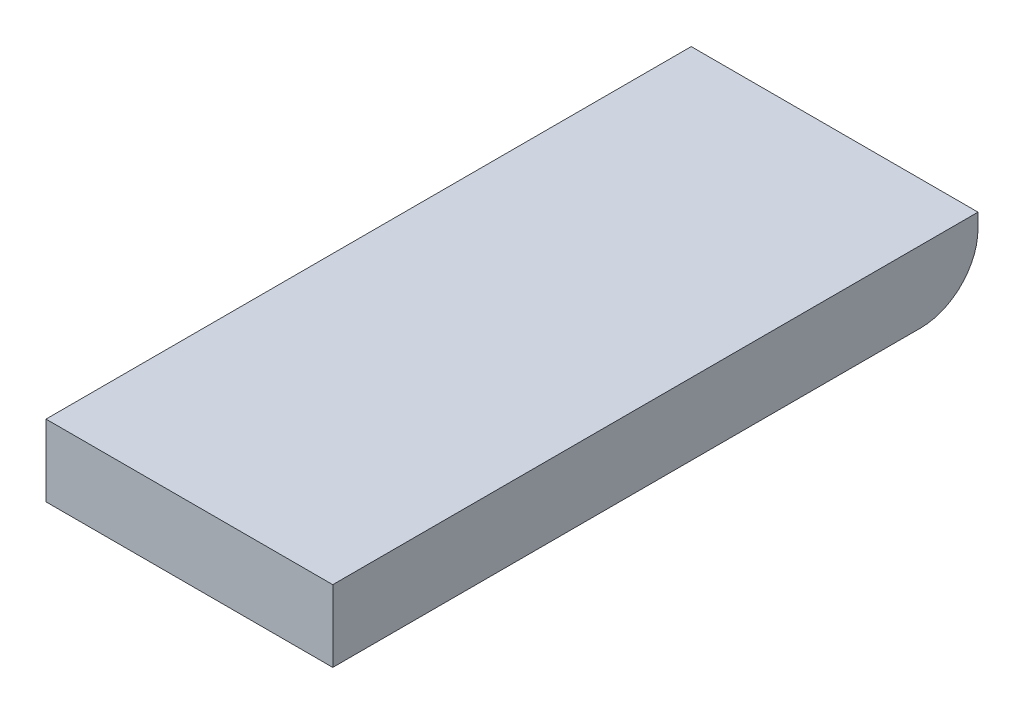
ISO-10303-21;
HEADER;
FILE_DESCRIPTION(('STEP AP214'),'2;1');
FILE_NAME('part.step','',(''),(''),'','','');
FILE_SCHEMA(('AUTOMOTIVE_DESIGN { 1 0 10303 214 1 1 1 1 }'));
ENDSEC;
DATA;
#1=APPLICATION_CONTEXT('core data for automotive mechanical design processes');
#2=APPLICATION_PROTOCOL_DEFINITION('international standard','automotive_design',2000,#1);
#3=PRODUCT_CONTEXT('',#1,'mechanical');
#4=PRODUCT('Part','Part','',(#3));
#5=PRODUCT_RELATED_PRODUCT_CATEGORY('part','',(#4));
#6=PRODUCT_DEFINITION_FORMATION('','',#4);
#7=PRODUCT_DEFINITION_CONTEXT('part definition',#1,'design');
#8=PRODUCT_DEFINITION('design','',#6,#7);
#9=PRODUCT_DEFINITION_SHAPE('','',#8);
#10=(LENGTH_UNIT() NAMED_UNIT(*) SI_UNIT(.MILLI.,.METRE.));
#11=(NAMED_UNIT(*) PLANE_ANGLE_UNIT() SI_UNIT($,.RADIAN.));
#12=(NAMED_UNIT(*) SI_UNIT($,.STERADIAN.) SOLID_ANGLE_UNIT());
#13=UNCERTAINTY_MEASURE_WITH_UNIT(LENGTH_MEASURE(1.E-05),#10,'distance_accuracy_value','');
#14=(GEOMETRIC_REPRESENTATION_CONTEXT(3) GLOBAL_UNCERTAINTY_ASSIGNED_CONTEXT((#13)) GLOBAL_UNIT_ASSIGNED_CONTEXT((#10,
#11,#12)) REPRESENTATION_CONTEXT('',''));
#15=CARTESIAN_POINT('',(0.,0.,0.));
#16=DIRECTION('',(0.,0.,1.));
#17=DIRECTION('',(1.,0.,0.));
#18=AXIS2_PLACEMENT_3D('',#15,#16,#17);
#19=CARTESIAN_POINT('',(4.4,0.1,3.95));
#20=DIRECTION('',(-1.,0.,0.));
#21=DIRECTION('',(0.,0.,1.));
#22=AXIS2_PLACEMENT_3D('',#19,#20,#21);
#23=CYLINDRICAL_SURFACE('',#22,0.2);
#24=CARTESIAN_POINT('',(5.4,0.1,3.95));
#25=DIRECTION('',(-1.,0.,0.));
#26=DIRECTION('',(0.,0.,1.));
#27=AXIS2_PLACEMENT_3D('',#24,#25,#26);
#28=CIRCLE('',#27,0.2);
#29=CARTESIAN_POINT('',(5.4,-0.1,3.95));
#30=VERTEX_POINT('',#29);
#31=CARTESIAN_POINT('',(5.4,0.1,3.75));
#32=VERTEX_POINT('',#31);
#33=EDGE_CURVE('E21',#30,#32,#28,.F.);
#34=ORIENTED_EDGE('',*,*,#33,.F.);
#35=DIRECTION('',(1.,0.,0.));
#36=VECTOR('',#35,1.);
#37=CARTESIAN_POINT('',(4.4,-0.1,3.95));
#38=LINE('',#37,#36);
#39=CARTESIAN_POINT('',(4.4,-0.1,3.95));
#40=VERTEX_POINT('',#39);
#41=EDGE_CURVE('E62',#40,#30,#38,.T.);
#42=ORIENTED_EDGE('',*,*,#41,.F.);
#43=CARTESIAN_POINT('',(4.4,0.1,3.95));
#44=DIRECTION('',(-1.,0.,0.));
#45=DIRECTION('',(0.,0.,1.));
#46=AXIS2_PLACEMENT_3D('',#43,#44,#45);
#47=CIRCLE('',#46,0.2);
#48=CARTESIAN_POINT('',(4.4,0.1,3.75));
#49=VERTEX_POINT('',#48);
#50=EDGE_CURVE('E78',#49,#40,#47,.T.);
#51=ORIENTED_EDGE('',*,*,#50,.F.);
#52=DIRECTION('',(-1.,0.,0.));
#53=VECTOR('',#52,1.);
#54=CARTESIAN_POINT('',(4.4,0.1,3.75));
#55=LINE('',#54,#53);
#56=EDGE_CURVE('E77',#32,#49,#55,.T.);
#57=ORIENTED_EDGE('',*,*,#56,.F.);
#58=EDGE_LOOP('',(#34,#42,#51,#57));
#59=FACE_BOUND('',#58,.T.);
#60=ADVANCED_FACE('F18',(#59),#23,.T.);
#61=CARTESIAN_POINT('',(4.4,-0.1,6.));
#62=DIRECTION('',(0.,-1.,0.));
#63=DIRECTION('',(0.,0.,-1.));
#64=AXIS2_PLACEMENT_3D('',#61,#62,#63);
#65=PLANE('',#64);
#66=DIRECTION('',(0.,0.,-1.));
#67=VECTOR('',#66,1.);
#68=CARTESIAN_POINT('',(5.4,-0.1,3.75));
#69=LINE('',#68,#67);
#70=CARTESIAN_POINT('',(5.4,-0.1,6.));
#71=VERTEX_POINT('',#70);
#72=EDGE_CURVE('E74',#71,#30,#69,.T.);
#73=ORIENTED_EDGE('',*,*,#72,.F.);
#74=DIRECTION('',(1.,0.,0.));
#75=VECTOR('',#74,1.);
#76=CARTESIAN_POINT('',(5.4,-0.1,6.));
#77=LINE('',#76,#75);
#78=CARTESIAN_POINT('',(4.4,-0.1,6.));
#79=VERTEX_POINT('',#78);
#80=EDGE_CURVE('E86',#79,#71,#77,.T.);
#81=ORIENTED_EDGE('',*,*,#80,.F.);
#82=DIRECTION('',(0.,0.,1.));
#83=VECTOR('',#82,1.);
#84=CARTESIAN_POINT('',(4.4,-0.1,3.75));
#85=LINE('',#84,#83);
#86=EDGE_CURVE('E103',#40,#79,#85,.T.);
#87=ORIENTED_EDGE('',*,*,#86,.F.);
#88=ORIENTED_EDGE('',*,*,#41,.T.);
#89=EDGE_LOOP('',(#73,#81,#87,#88));
#90=FACE_BOUND('',#89,.T.);
#91=ADVANCED_FACE('F141',(#90),#65,.T.);
#92=CARTESIAN_POINT('',(4.4,0.15,3.75));
#93=DIRECTION('',(0.,0.,-1.));
#94=DIRECTION('',(-1.,0.,0.));
#95=AXIS2_PLACEMENT_3D('',#92,#93,#94);
#96=PLANE('',#95);
#97=DIRECTION('',(0.,1.,0.));
#98=VECTOR('',#97,1.);
#99=CARTESIAN_POINT('',(4.4,0.15,3.75));
#100=LINE('',#99,#98);
#101=CARTESIAN_POINT('',(4.4,0.15,3.75));
#102=VERTEX_POINT('',#101);
#103=EDGE_CURVE('E113',#102,#49,#100,.F.);
#104=ORIENTED_EDGE('',*,*,#103,.F.);
#105=DIRECTION('',(1.,0.,0.));
#106=VECTOR('',#105,1.);
#107=CARTESIAN_POINT('',(4.4,0.15,3.75));
#108=LINE('',#107,#106);
#109=CARTESIAN_POINT('',(5.4,0.15,3.75));
#110=VERTEX_POINT('',#109);
#111=EDGE_CURVE('E85',#102,#110,#108,.T.);
#112=ORIENTED_EDGE('',*,*,#111,.T.);
#113=DIRECTION('',(0.,1.,0.));
#114=VECTOR('',#113,1.);
#115=CARTESIAN_POINT('',(5.4,0.15,3.75));
#116=LINE('',#115,#114);
#117=EDGE_CURVE('E71',#32,#110,#116,.T.);
#118=ORIENTED_EDGE('',*,*,#117,.F.);
#119=ORIENTED_EDGE('',*,*,#56,.T.);
#120=EDGE_LOOP('',(#104,#112,#118,#119));
#121=FACE_BOUND('',#120,.T.);
#122=ADVANCED_FACE('F84',(#121),#96,.T.);
#123=CARTESIAN_POINT('',(5.4,0.15,3.75));
#124=DIRECTION('',(1.,0.,0.));
#125=DIRECTION('',(0.,0.,-1.));
#126=AXIS2_PLACEMENT_3D('',#123,#124,#125);
#127=PLANE('',#126);
#128=DIRECTION('',(0.,0.,-1.));
#129=VECTOR('',#128,1.);
#130=CARTESIAN_POINT('',(5.4,0.15,6.));
#131=LINE('',#130,#129);
#132=CARTESIAN_POINT('',(5.4,0.15,6.));
#133=VERTEX_POINT('',#132);
#134=EDGE_CURVE('E107',#110,#133,#131,.F.);
#135=ORIENTED_EDGE('',*,*,#134,.T.);
#136=DIRECTION('',(0.,1.,0.));
#137=VECTOR('',#136,1.);
#138=CARTESIAN_POINT('',(5.4,0.15,6.));
#139=LINE('',#138,#137);
#140=EDGE_CURVE('E88',#71,#133,#139,.T.);
#141=ORIENTED_EDGE('',*,*,#140,.F.);
#142=ORIENTED_EDGE('',*,*,#72,.T.);
#143=ORIENTED_EDGE('',*,*,#33,.T.);
#144=ORIENTED_EDGE('',*,*,#117,.T.);
#145=EDGE_LOOP('',(#135,#141,#142,#143,#144));
#146=FACE_BOUND('',#145,.T.);
#147=ADVANCED_FACE('F69',(#146),#127,.T.);
#148=CARTESIAN_POINT('',(5.4,0.15,6.));
#149=DIRECTION('',(0.,0.,1.));
#150=DIRECTION('',(1.,0.,0.));
#151=AXIS2_PLACEMENT_3D('',#148,#149,#150);
#152=PLANE('',#151);
#153=ORIENTED_EDGE('',*,*,#140,.T.);
#154=DIRECTION('',(1.,0.,0.));
#155=VECTOR('',#154,1.);
#156=CARTESIAN_POINT('',(4.4,0.15,6.));
#157=LINE('',#156,#155);
#158=CARTESIAN_POINT('',(4.4,0.15,6.));
#159=VERTEX_POINT('',#158);
#160=EDGE_CURVE('E27',#133,#159,#157,.F.);
#161=ORIENTED_EDGE('',*,*,#160,.T.);
#162=DIRECTION('',(0.,1.,0.));
#163=VECTOR('',#162,1.);
#164=CARTESIAN_POINT('',(4.4,0.15,6.));
#165=LINE('',#164,#163);
#166=EDGE_CURVE('E35',#79,#159,#165,.T.);
#167=ORIENTED_EDGE('',*,*,#166,.F.);
#168=ORIENTED_EDGE('',*,*,#80,.T.);
#169=EDGE_LOOP('',(#153,#161,#167,#168));
#170=FACE_BOUND('',#169,.T.);
#171=ADVANCED_FACE('F125',(#170),#152,.T.);
#172=CARTESIAN_POINT('',(4.4,0.15,3.75));
#173=DIRECTION('',(-1.,0.,0.));
#174=DIRECTION('',(0.,0.,1.));
#175=AXIS2_PLACEMENT_3D('',#172,#173,#174);
#176=PLANE('',#175);
#177=ORIENTED_EDGE('',*,*,#166,.T.);
#178=DIRECTION('',(0.,0.,-1.));
#179=VECTOR('',#178,1.);
#180=CARTESIAN_POINT('',(4.4,0.15,6.));
#181=LINE('',#180,#179);
#182=EDGE_CURVE('E11',#159,#102,#181,.T.);
#183=ORIENTED_EDGE('',*,*,#182,.T.);
#184=ORIENTED_EDGE('',*,*,#103,.T.);
#185=ORIENTED_EDGE('',*,*,#50,.T.);
#186=ORIENTED_EDGE('',*,*,#86,.T.);
#187=EDGE_LOOP('',(#177,#183,#184,#185,#186));
#188=FACE_BOUND('',#187,.T.);
#189=ADVANCED_FACE('F128',(#188),#176,.T.);
#190=CARTESIAN_POINT('',(4.4,0.15,6.));
#191=DIRECTION('',(0.,-1.,0.));
#192=DIRECTION('',(0.,0.,-1.));
#193=AXIS2_PLACEMENT_3D('',#190,#191,#192);
#194=PLANE('',#193);
#195=ORIENTED_EDGE('',*,*,#160,.F.);
#196=ORIENTED_EDGE('',*,*,#134,.F.);
#197=ORIENTED_EDGE('',*,*,#111,.F.);
#198=ORIENTED_EDGE('',*,*,#182,.F.);
#199=EDGE_LOOP('',(#195,#196,#197,#198));
#200=FACE_BOUND('',#199,.T.);
#201=ADVANCED_FACE('F127',(#200),#194,.F.);
#202=CLOSED_SHELL('',(#60,#91,#122,#147,#171,#189,#201));
#203=MANIFOLD_SOLID_BREP('B1',#202);
#204=ADVANCED_BREP_SHAPE_REPRESENTATION('',(#18,#203),#14);
#205=SHAPE_DEFINITION_REPRESENTATION(#9,#204);
ENDSEC;
END-ISO-10303-21;
